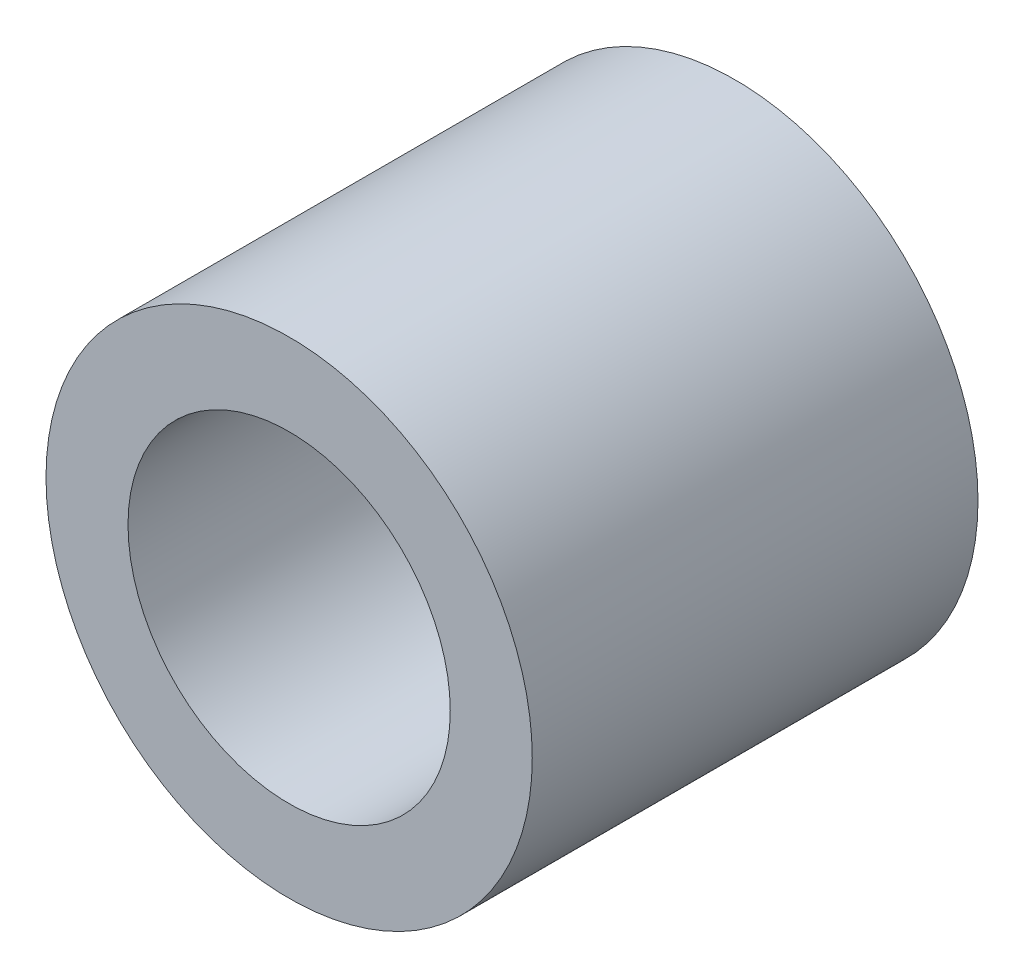
ISO-10303-21;
HEADER;
FILE_DESCRIPTION(('STEP AP214'),'2;1');
FILE_NAME('part.step','',(''),(''),'','','');
FILE_SCHEMA(('AUTOMOTIVE_DESIGN { 1 0 10303 214 1 1 1 1 }'));
ENDSEC;
DATA;
#1=APPLICATION_CONTEXT('core data for automotive mechanical design processes');
#2=APPLICATION_PROTOCOL_DEFINITION('international standard','automotive_design',2000,#1);
#3=PRODUCT_CONTEXT('',#1,'mechanical');
#4=PRODUCT('Part','Part','',(#3));
#5=PRODUCT_RELATED_PRODUCT_CATEGORY('part','',(#4));
#6=PRODUCT_DEFINITION_FORMATION('','',#4);
#7=PRODUCT_DEFINITION_CONTEXT('part definition',#1,'design');
#8=PRODUCT_DEFINITION('design','',#6,#7);
#9=PRODUCT_DEFINITION_SHAPE('','',#8);
#10=(LENGTH_UNIT() NAMED_UNIT(*) SI_UNIT(.MILLI.,.METRE.));
#11=(NAMED_UNIT(*) PLANE_ANGLE_UNIT() SI_UNIT($,.RADIAN.));
#12=(NAMED_UNIT(*) SI_UNIT($,.STERADIAN.) SOLID_ANGLE_UNIT());
#13=UNCERTAINTY_MEASURE_WITH_UNIT(LENGTH_MEASURE(1.E-05),#10,'distance_accuracy_value','');
#14=(GEOMETRIC_REPRESENTATION_CONTEXT(3) GLOBAL_UNCERTAINTY_ASSIGNED_CONTEXT((#13)) GLOBAL_UNIT_ASSIGNED_CONTEXT((#10,
#11,#12)) REPRESENTATION_CONTEXT('',''));
#15=CARTESIAN_POINT('',(0.,0.,0.));
#16=DIRECTION('',(0.,0.,1.));
#17=DIRECTION('',(1.,0.,0.));
#18=AXIS2_PLACEMENT_3D('',#15,#16,#17);
#19=CARTESIAN_POINT('',(0.,0.,6.985));
#20=DIRECTION('',(0.,0.,1.));
#21=DIRECTION('',(1.,0.,0.));
#22=AXIS2_PLACEMENT_3D('',#19,#20,#21);
#23=PLANE('',#22);
#24=CARTESIAN_POINT('',(0.,0.,6.985));
#25=DIRECTION('',(0.,0.,1.));
#26=DIRECTION('',(1.,0.,0.));
#27=AXIS2_PLACEMENT_3D('',#24,#25,#26);
#28=CIRCLE('',#27,3.81);
#29=CARTESIAN_POINT('',(3.81,0.,6.985));
#30=VERTEX_POINT('',#29);
#31=EDGE_CURVE('E10',#30,#30,#28,.T.);
#32=ORIENTED_EDGE('',*,*,#31,.T.);
#33=EDGE_LOOP('',(#32));
#34=FACE_BOUND('',#33,.T.);
#35=CARTESIAN_POINT('',(0.,0.,6.985));
#36=DIRECTION('',(0.,0.,1.));
#37=DIRECTION('',(1.,0.,0.));
#38=AXIS2_PLACEMENT_3D('',#35,#36,#37);
#39=CIRCLE('',#38,2.525);
#40=CARTESIAN_POINT('',(2.525,0.,6.985));
#41=VERTEX_POINT('',#40);
#42=EDGE_CURVE('E50',#41,#41,#39,.T.);
#43=ORIENTED_EDGE('',*,*,#42,.F.);
#44=EDGE_LOOP('',(#43));
#45=FACE_BOUND('',#44,.T.);
#46=ADVANCED_FACE('F37',(#34,#45),#23,.T.);
#47=CARTESIAN_POINT('',(0.,0.,0.));
#48=DIRECTION('',(0.,0.,1.));
#49=DIRECTION('',(1.,0.,0.));
#50=AXIS2_PLACEMENT_3D('',#47,#48,#49);
#51=PLANE('',#50);
#52=CARTESIAN_POINT('',(0.,0.,0.));
#53=DIRECTION('',(0.,0.,1.));
#54=DIRECTION('',(1.,0.,0.));
#55=AXIS2_PLACEMENT_3D('',#52,#53,#54);
#56=CIRCLE('',#55,3.81);
#57=CARTESIAN_POINT('',(3.81,0.,0.));
#58=VERTEX_POINT('',#57);
#59=EDGE_CURVE('E41',#58,#58,#56,.T.);
#60=ORIENTED_EDGE('',*,*,#59,.F.);
#61=EDGE_LOOP('',(#60));
#62=FACE_BOUND('',#61,.T.);
#63=CARTESIAN_POINT('',(0.,0.,0.));
#64=DIRECTION('',(0.,0.,1.));
#65=DIRECTION('',(1.,0.,0.));
#66=AXIS2_PLACEMENT_3D('',#63,#64,#65);
#67=CIRCLE('',#66,2.525);
#68=CARTESIAN_POINT('',(2.525,0.,0.));
#69=VERTEX_POINT('',#68);
#70=EDGE_CURVE('E52',#69,#69,#67,.T.);
#71=ORIENTED_EDGE('',*,*,#70,.T.);
#72=EDGE_LOOP('',(#71));
#73=FACE_BOUND('',#72,.T.);
#74=ADVANCED_FACE('F64',(#62,#73),#51,.F.);
#75=CARTESIAN_POINT('',(0.,0.,6.985));
#76=DIRECTION('',(0.,0.,-1.));
#77=DIRECTION('',(-1.,0.,0.));
#78=AXIS2_PLACEMENT_3D('',#75,#76,#77);
#79=CYLINDRICAL_SURFACE('',#78,3.81);
#80=ORIENTED_EDGE('',*,*,#31,.F.);
#81=EDGE_LOOP('',(#80));
#82=FACE_BOUND('',#81,.T.);
#83=ORIENTED_EDGE('',*,*,#59,.T.);
#84=EDGE_LOOP('',(#83));
#85=FACE_BOUND('',#84,.T.);
#86=ADVANCED_FACE('F39',(#82,#85),#79,.T.);
#87=CARTESIAN_POINT('',(0.,0.,6.985));
#88=DIRECTION('',(0.,0.,-1.));
#89=DIRECTION('',(-1.,0.,0.));
#90=AXIS2_PLACEMENT_3D('',#87,#88,#89);
#91=CYLINDRICAL_SURFACE('',#90,2.525);
#92=ORIENTED_EDGE('',*,*,#42,.T.);
#93=EDGE_LOOP('',(#92));
#94=FACE_BOUND('',#93,.T.);
#95=ORIENTED_EDGE('',*,*,#70,.F.);
#96=EDGE_LOOP('',(#95));
#97=FACE_BOUND('',#96,.T.);
#98=ADVANCED_FACE('F60',(#94,#97),#91,.F.);
#99=CLOSED_SHELL('',(#46,#74,#86,#98));
#100=MANIFOLD_SOLID_BREP('B2',#99);
#101=ADVANCED_BREP_SHAPE_REPRESENTATION('',(#18,#100),#14);
#102=SHAPE_DEFINITION_REPRESENTATION(#9,#101);
ENDSEC;
END-ISO-10303-21;
